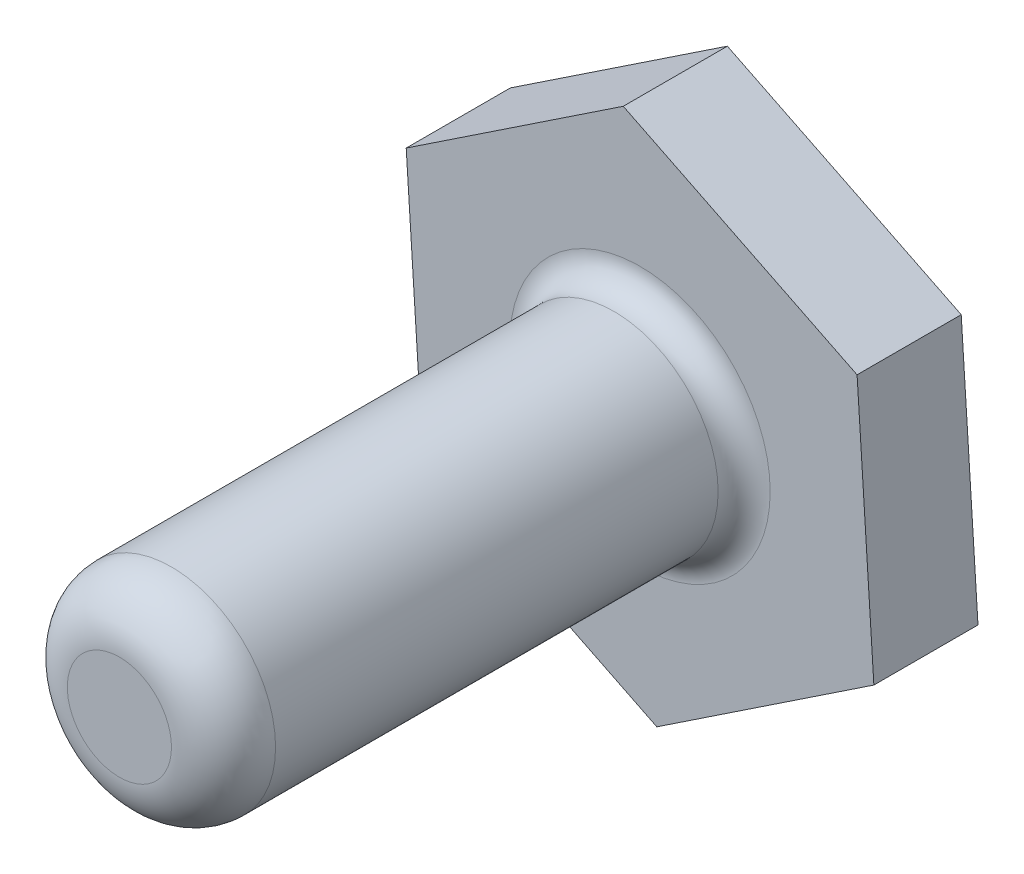
ISO-10303-21;
HEADER;
FILE_DESCRIPTION(('STEP AP214'),'2;1');
FILE_NAME('part.step','',(''),(''),'','','');
FILE_SCHEMA(('AUTOMOTIVE_DESIGN { 1 0 10303 214 1 1 1 1 }'));
ENDSEC;
DATA;
#1=APPLICATION_CONTEXT('core data for automotive mechanical design processes');
#2=APPLICATION_PROTOCOL_DEFINITION('international standard','automotive_design',2000,#1);
#3=PRODUCT_CONTEXT('',#1,'mechanical');
#4=PRODUCT('Part','Part','',(#3));
#5=PRODUCT_RELATED_PRODUCT_CATEGORY('part','',(#4));
#6=PRODUCT_DEFINITION_FORMATION('','',#4);
#7=PRODUCT_DEFINITION_CONTEXT('part definition',#1,'design');
#8=PRODUCT_DEFINITION('design','',#6,#7);
#9=PRODUCT_DEFINITION_SHAPE('','',#8);
#10=(LENGTH_UNIT() NAMED_UNIT(*) SI_UNIT(.MILLI.,.METRE.));
#11=(NAMED_UNIT(*) PLANE_ANGLE_UNIT() SI_UNIT($,.RADIAN.));
#12=(NAMED_UNIT(*) SI_UNIT($,.STERADIAN.) SOLID_ANGLE_UNIT());
#13=UNCERTAINTY_MEASURE_WITH_UNIT(LENGTH_MEASURE(1.E-05),#10,'distance_accuracy_value','');
#14=(GEOMETRIC_REPRESENTATION_CONTEXT(3) GLOBAL_UNCERTAINTY_ASSIGNED_CONTEXT((#13)) GLOBAL_UNIT_ASSIGNED_CONTEXT((#10,
#11,#12)) REPRESENTATION_CONTEXT('',''));
#15=CARTESIAN_POINT('',(0.,0.,0.));
#16=DIRECTION('',(0.,0.,1.));
#17=DIRECTION('',(1.,0.,0.));
#18=AXIS2_PLACEMENT_3D('',#15,#16,#17);
#19=CARTESIAN_POINT('',(-0.644804231018823,10.,4.));
#20=DIRECTION('',(0.5546897568361,-0.832057253836001,0.));
#21=DIRECTION('',(0.832057253836001,0.5546897568361,0.));
#22=AXIS2_PLACEMENT_3D('',#19,#20,#21);
#23=PLANE('',#22);
#24=DIRECTION('',(-0.832057253836001,-0.5546897568361,0.));
#25=VECTOR('',#24,1.);
#26=CARTESIAN_POINT('',(-0.644804231018823,10.,0.));
#27=LINE('',#26,#25);
#28=CARTESIAN_POINT('',(-0.644804231018823,10.,0.));
#29=VERTEX_POINT('',#28);
#30=CARTESIAN_POINT('',(-8.9826561533538,4.44158315547001,0.));
#31=VERTEX_POINT('',#30);
#32=EDGE_CURVE('E130',#29,#31,#27,.T.);
#33=ORIENTED_EDGE('',*,*,#32,.T.);
#34=DIRECTION('',(0.,0.,-1.));
#35=VECTOR('',#34,1.);
#36=CARTESIAN_POINT('',(-8.9826561533538,4.44158315547001,4.));
#37=LINE('',#36,#35);
#38=CARTESIAN_POINT('',(-8.9826561533538,4.44158315547001,4.));
#39=VERTEX_POINT('',#38);
#40=EDGE_CURVE('E157',#39,#31,#37,.T.);
#41=ORIENTED_EDGE('',*,*,#40,.F.);
#42=DIRECTION('',(-0.832057253836001,-0.5546897568361,0.));
#43=VECTOR('',#42,1.);
#44=CARTESIAN_POINT('',(-0.644804231018823,10.,4.));
#45=LINE('',#44,#43);
#46=CARTESIAN_POINT('',(-0.644804231018823,10.,4.));
#47=VERTEX_POINT('',#46);
#48=EDGE_CURVE('E146',#47,#39,#45,.T.);
#49=ORIENTED_EDGE('',*,*,#48,.F.);
#50=DIRECTION('',(0.,0.,-1.));
#51=VECTOR('',#50,1.);
#52=CARTESIAN_POINT('',(-0.644804231018823,10.,4.));
#53=LINE('',#52,#51);
#54=EDGE_CURVE('E126',#47,#29,#53,.T.);
#55=ORIENTED_EDGE('',*,*,#54,.T.);
#56=EDGE_LOOP('',(#33,#41,#49,#55));
#57=FACE_BOUND('',#56,.T.);
#58=ADVANCED_FACE('F39',(#57),#23,.F.);
#59=CARTESIAN_POINT('',(-8.9826561533538,4.44158315547001,4.));
#60=DIRECTION('',(0.997927597643144,0.0643467937210753,0.));
#61=DIRECTION('',(-0.0643467937210753,0.997927597643144,0.));
#62=AXIS2_PLACEMENT_3D('',#59,#60,#61);
#63=PLANE('',#62);
#64=DIRECTION('',(0.0643467937210753,-0.997927597643144,0.));
#65=VECTOR('',#64,1.);
#66=CARTESIAN_POINT('',(-8.9826561533538,4.44158315547001,0.));
#67=LINE('',#66,#65);
#68=CARTESIAN_POINT('',(-8.33785192233497,-5.55841684452999,0.));
#69=VERTEX_POINT('',#68);
#70=EDGE_CURVE('E134',#31,#69,#67,.T.);
#71=ORIENTED_EDGE('',*,*,#70,.T.);
#72=DIRECTION('',(0.,0.,-1.));
#73=VECTOR('',#72,1.);
#74=CARTESIAN_POINT('',(-8.33785192233497,-5.55841684452999,4.));
#75=LINE('',#74,#73);
#76=CARTESIAN_POINT('',(-8.33785192233497,-5.55841684452999,4.));
#77=VERTEX_POINT('',#76);
#78=EDGE_CURVE('E153',#77,#69,#75,.T.);
#79=ORIENTED_EDGE('',*,*,#78,.F.);
#80=DIRECTION('',(0.0643467937210753,-0.997927597643144,0.));
#81=VECTOR('',#80,1.);
#82=CARTESIAN_POINT('',(-8.9826561533538,4.44158315547001,4.));
#83=LINE('',#82,#81);
#84=EDGE_CURVE('E95',#39,#77,#83,.T.);
#85=ORIENTED_EDGE('',*,*,#84,.F.);
#86=ORIENTED_EDGE('',*,*,#40,.T.);
#87=EDGE_LOOP('',(#71,#79,#85,#86));
#88=FACE_BOUND('',#87,.T.);
#89=ADVANCED_FACE('F182',(#88),#63,.F.);
#90=CARTESIAN_POINT('',(-8.33785192233497,-5.55841684452999,4.));
#91=DIRECTION('',(0.443237840807044,0.896404047557076,0.));
#92=DIRECTION('',(-0.896404047557076,0.443237840807044,0.));
#93=AXIS2_PLACEMENT_3D('',#90,#91,#92);
#94=PLANE('',#93);
#95=DIRECTION('',(0.896404047557076,-0.443237840807044,0.));
#96=VECTOR('',#95,1.);
#97=CARTESIAN_POINT('',(-8.33785192233497,-5.55841684452999,0.));
#98=LINE('',#97,#96);
#99=CARTESIAN_POINT('',(0.644804231018821,-10.,0.));
#100=VERTEX_POINT('',#99);
#101=EDGE_CURVE('E137',#69,#100,#98,.T.);
#102=ORIENTED_EDGE('',*,*,#101,.T.);
#103=DIRECTION('',(0.,0.,-1.));
#104=VECTOR('',#103,1.);
#105=CARTESIAN_POINT('',(0.644804231018821,-10.,4.));
#106=LINE('',#105,#104);
#107=CARTESIAN_POINT('',(0.644804231018821,-10.,4.));
#108=VERTEX_POINT('',#107);
#109=EDGE_CURVE('E119',#108,#100,#106,.T.);
#110=ORIENTED_EDGE('',*,*,#109,.F.);
#111=DIRECTION('',(0.896404047557076,-0.443237840807044,0.));
#112=VECTOR('',#111,1.);
#113=CARTESIAN_POINT('',(-8.33785192233497,-5.55841684452999,4.));
#114=LINE('',#113,#112);
#115=EDGE_CURVE('E108',#77,#108,#114,.T.);
#116=ORIENTED_EDGE('',*,*,#115,.F.);
#117=ORIENTED_EDGE('',*,*,#78,.T.);
#118=EDGE_LOOP('',(#102,#110,#116,#117));
#119=FACE_BOUND('',#118,.T.);
#120=ADVANCED_FACE('F188',(#119),#94,.F.);
#121=CARTESIAN_POINT('',(0.644804231018821,-10.,4.));
#122=DIRECTION('',(-0.5546897568361,0.832057253836001,0.));
#123=DIRECTION('',(-0.832057253836001,-0.5546897568361,0.));
#124=AXIS2_PLACEMENT_3D('',#121,#122,#123);
#125=PLANE('',#124);
#126=DIRECTION('',(0.832057253836001,0.5546897568361,0.));
#127=VECTOR('',#126,1.);
#128=CARTESIAN_POINT('',(0.644804231018821,-10.,0.));
#129=LINE('',#128,#127);
#130=CARTESIAN_POINT('',(8.9826561533538,-4.44158315547,0.));
#131=VERTEX_POINT('',#130);
#132=EDGE_CURVE('E117',#100,#131,#129,.T.);
#133=ORIENTED_EDGE('',*,*,#132,.T.);
#134=DIRECTION('',(0.,0.,-1.));
#135=VECTOR('',#134,1.);
#136=CARTESIAN_POINT('',(8.9826561533538,-4.44158315547,4.));
#137=LINE('',#136,#135);
#138=CARTESIAN_POINT('',(8.9826561533538,-4.44158315547,4.));
#139=VERTEX_POINT('',#138);
#140=EDGE_CURVE('E114',#139,#131,#137,.T.);
#141=ORIENTED_EDGE('',*,*,#140,.F.);
#142=DIRECTION('',(0.832057253836001,0.5546897568361,0.));
#143=VECTOR('',#142,1.);
#144=CARTESIAN_POINT('',(0.644804231018821,-10.,4.));
#145=LINE('',#144,#143);
#146=EDGE_CURVE('E102',#108,#139,#145,.T.);
#147=ORIENTED_EDGE('',*,*,#146,.F.);
#148=ORIENTED_EDGE('',*,*,#109,.T.);
#149=EDGE_LOOP('',(#133,#141,#147,#148));
#150=FACE_BOUND('',#149,.T.);
#151=ADVANCED_FACE('F115',(#150),#125,.F.);
#152=CARTESIAN_POINT('',(8.9826561533538,-4.44158315547,4.));
#153=DIRECTION('',(-0.997927597643144,-0.0643467937210751,0.));
#154=DIRECTION('',(0.0643467937210751,-0.997927597643144,0.));
#155=AXIS2_PLACEMENT_3D('',#152,#153,#154);
#156=PLANE('',#155);
#157=DIRECTION('',(-0.0643467937210751,0.997927597643144,0.));
#158=VECTOR('',#157,1.);
#159=CARTESIAN_POINT('',(8.9826561533538,-4.44158315547,0.));
#160=LINE('',#159,#158);
#161=CARTESIAN_POINT('',(8.33785192233497,5.55841684452999,0.));
#162=VERTEX_POINT('',#161);
#163=EDGE_CURVE('E80',#131,#162,#160,.T.);
#164=ORIENTED_EDGE('',*,*,#163,.T.);
#165=DIRECTION('',(0.,0.,-1.));
#166=VECTOR('',#165,1.);
#167=CARTESIAN_POINT('',(8.33785192233497,5.55841684452999,4.));
#168=LINE('',#167,#166);
#169=CARTESIAN_POINT('',(8.33785192233497,5.55841684452999,4.));
#170=VERTEX_POINT('',#169);
#171=EDGE_CURVE('E120',#170,#162,#168,.T.);
#172=ORIENTED_EDGE('',*,*,#171,.F.);
#173=DIRECTION('',(-0.0643467937210751,0.997927597643144,0.));
#174=VECTOR('',#173,1.);
#175=CARTESIAN_POINT('',(8.9826561533538,-4.44158315547,4.));
#176=LINE('',#175,#174);
#177=EDGE_CURVE('E106',#139,#170,#176,.T.);
#178=ORIENTED_EDGE('',*,*,#177,.F.);
#179=ORIENTED_EDGE('',*,*,#140,.T.);
#180=EDGE_LOOP('',(#164,#172,#178,#179));
#181=FACE_BOUND('',#180,.T.);
#182=ADVANCED_FACE('F122',(#181),#156,.F.);
#183=CARTESIAN_POINT('',(8.33785192233497,5.55841684452999,4.));
#184=DIRECTION('',(-0.443237840807044,-0.896404047557076,0.));
#185=DIRECTION('',(0.896404047557076,-0.443237840807044,0.));
#186=AXIS2_PLACEMENT_3D('',#183,#184,#185);
#187=PLANE('',#186);
#188=DIRECTION('',(-0.896404047557076,0.443237840807044,0.));
#189=VECTOR('',#188,1.);
#190=CARTESIAN_POINT('',(8.33785192233497,5.55841684452999,0.));
#191=LINE('',#190,#189);
#192=EDGE_CURVE('E86',#162,#29,#191,.T.);
#193=ORIENTED_EDGE('',*,*,#192,.T.);
#194=ORIENTED_EDGE('',*,*,#54,.F.);
#195=DIRECTION('',(-0.896404047557076,0.443237840807044,0.));
#196=VECTOR('',#195,1.);
#197=CARTESIAN_POINT('',(8.33785192233497,5.55841684452999,4.));
#198=LINE('',#197,#196);
#199=EDGE_CURVE('E57',#170,#47,#198,.T.);
#200=ORIENTED_EDGE('',*,*,#199,.F.);
#201=ORIENTED_EDGE('',*,*,#171,.T.);
#202=EDGE_LOOP('',(#193,#194,#200,#201));
#203=FACE_BOUND('',#202,.T.);
#204=ADVANCED_FACE('F198',(#203),#187,.F.);
#205=CARTESIAN_POINT('',(0.,0.,4.));
#206=DIRECTION('',(0.,0.,1.));
#207=DIRECTION('',(1.,0.,0.));
#208=AXIS2_PLACEMENT_3D('',#205,#206,#207);
#209=PLANE('',#208);
#210=CARTESIAN_POINT('',(0.,0.,4.));
#211=DIRECTION('',(0.,0.,1.));
#212=DIRECTION('',(1.,0.,0.));
#213=AXIS2_PLACEMENT_3D('',#210,#211,#212);
#214=CIRCLE('',#213,5.);
#215=CARTESIAN_POINT('',(5.,0.,4.));
#216=VERTEX_POINT('',#215);
#217=EDGE_CURVE('E164',#216,#216,#214,.F.);
#218=ORIENTED_EDGE('',*,*,#217,.T.);
#219=EDGE_LOOP('',(#218));
#220=FACE_BOUND('',#219,.T.);
#221=ORIENTED_EDGE('',*,*,#48,.T.);
#222=ORIENTED_EDGE('',*,*,#84,.T.);
#223=ORIENTED_EDGE('',*,*,#115,.T.);
#224=ORIENTED_EDGE('',*,*,#146,.T.);
#225=ORIENTED_EDGE('',*,*,#177,.T.);
#226=ORIENTED_EDGE('',*,*,#199,.T.);
#227=EDGE_LOOP('',(#221,#222,#223,#224,#225,#226));
#228=FACE_BOUND('',#227,.T.);
#229=ADVANCED_FACE('F104',(#220,#228),#209,.T.);
#230=CARTESIAN_POINT('',(0.,0.,0.));
#231=DIRECTION('',(0.,0.,1.));
#232=DIRECTION('',(1.,0.,0.));
#233=AXIS2_PLACEMENT_3D('',#230,#231,#232);
#234=PLANE('',#233);
#235=ORIENTED_EDGE('',*,*,#32,.F.);
#236=ORIENTED_EDGE('',*,*,#192,.F.);
#237=ORIENTED_EDGE('',*,*,#163,.F.);
#238=ORIENTED_EDGE('',*,*,#132,.F.);
#239=ORIENTED_EDGE('',*,*,#101,.F.);
#240=ORIENTED_EDGE('',*,*,#70,.F.);
#241=EDGE_LOOP('',(#235,#236,#237,#238,#239,#240));
#242=FACE_BOUND('',#241,.T.);
#243=ADVANCED_FACE('F201',(#242),#234,.F.);
#244=CARTESIAN_POINT('',(0.,0.,24.));
#245=DIRECTION('',(0.,0.,-1.));
#246=DIRECTION('',(-1.,0.,0.));
#247=AXIS2_PLACEMENT_3D('',#244,#245,#246);
#248=CYLINDRICAL_SURFACE('',#247,4.);
#249=CARTESIAN_POINT('',(0.,0.,22.));
#250=DIRECTION('',(0.,0.,1.));
#251=DIRECTION('',(1.,0.,0.));
#252=AXIS2_PLACEMENT_3D('',#249,#250,#251);
#253=CIRCLE('',#252,4.);
#254=CARTESIAN_POINT('',(4.,0.,22.));
#255=VERTEX_POINT('',#254);
#256=EDGE_CURVE('E11',#255,#255,#253,.F.);
#257=ORIENTED_EDGE('',*,*,#256,.T.);
#258=EDGE_LOOP('',(#257));
#259=FACE_BOUND('',#258,.T.);
#260=CARTESIAN_POINT('',(0.,0.,5.));
#261=DIRECTION('',(0.,0.,1.));
#262=DIRECTION('',(1.,0.,0.));
#263=AXIS2_PLACEMENT_3D('',#260,#261,#262);
#264=CIRCLE('',#263,4.);
#265=CARTESIAN_POINT('',(4.,0.,5.));
#266=VERTEX_POINT('',#265);
#267=EDGE_CURVE('E160',#266,#266,#264,.T.);
#268=ORIENTED_EDGE('',*,*,#267,.T.);
#269=EDGE_LOOP('',(#268));
#270=FACE_BOUND('',#269,.T.);
#271=ADVANCED_FACE('F204',(#259,#270),#248,.T.);
#272=CARTESIAN_POINT('',(0.,0.,24.));
#273=DIRECTION('',(0.,0.,1.));
#274=DIRECTION('',(1.,0.,0.));
#275=AXIS2_PLACEMENT_3D('',#272,#273,#274);
#276=PLANE('',#275);
#277=CARTESIAN_POINT('',(0.,0.,24.));
#278=DIRECTION('',(0.,0.,1.));
#279=DIRECTION('',(1.,0.,0.));
#280=AXIS2_PLACEMENT_3D('',#277,#278,#279);
#281=CIRCLE('',#280,2.);
#282=CARTESIAN_POINT('',(2.,0.,24.));
#283=VERTEX_POINT('',#282);
#284=EDGE_CURVE('E49',#283,#283,#281,.T.);
#285=ORIENTED_EDGE('',*,*,#284,.T.);
#286=EDGE_LOOP('',(#285));
#287=FACE_BOUND('',#286,.T.);
#288=ADVANCED_FACE('F171',(#287),#276,.T.);
#289=CARTESIAN_POINT('',(0.,0.,5.));
#290=DIRECTION('',(0.,0.,1.));
#291=DIRECTION('',(1.,0.,0.));
#292=AXIS2_PLACEMENT_3D('',#289,#290,#291);
#293=TOROIDAL_SURFACE('',#292,5.,1.);
#294=ORIENTED_EDGE('',*,*,#217,.F.);
#295=EDGE_LOOP('',(#294));
#296=FACE_BOUND('',#295,.T.);
#297=ORIENTED_EDGE('',*,*,#267,.F.);
#298=EDGE_LOOP('',(#297));
#299=FACE_BOUND('',#298,.T.);
#300=ADVANCED_FACE('F174',(#296,#299),#293,.F.);
#301=CARTESIAN_POINT('',(0.,0.,22.));
#302=DIRECTION('',(0.,0.,1.));
#303=DIRECTION('',(1.,0.,0.));
#304=AXIS2_PLACEMENT_3D('',#301,#302,#303);
#305=DEGENERATE_TOROIDAL_SURFACE('',#304,2.,2.,.T.);
#306=ORIENTED_EDGE('',*,*,#256,.F.);
#307=EDGE_LOOP('',(#306));
#308=FACE_BOUND('',#307,.T.);
#309=ORIENTED_EDGE('',*,*,#284,.F.);
#310=EDGE_LOOP('',(#309));
#311=FACE_BOUND('',#310,.T.);
#312=ADVANCED_FACE('F41',(#308,#311),#305,.T.);
#313=CLOSED_SHELL('',(#58,#89,#120,#151,#182,#204,#229,#243,#271,#288,#300,#312));
#314=MANIFOLD_SOLID_BREP('B2',#313);
#315=ADVANCED_BREP_SHAPE_REPRESENTATION('',(#18,#314),#14);
#316=SHAPE_DEFINITION_REPRESENTATION(#9,#315);
ENDSEC;
END-ISO-10303-21;
